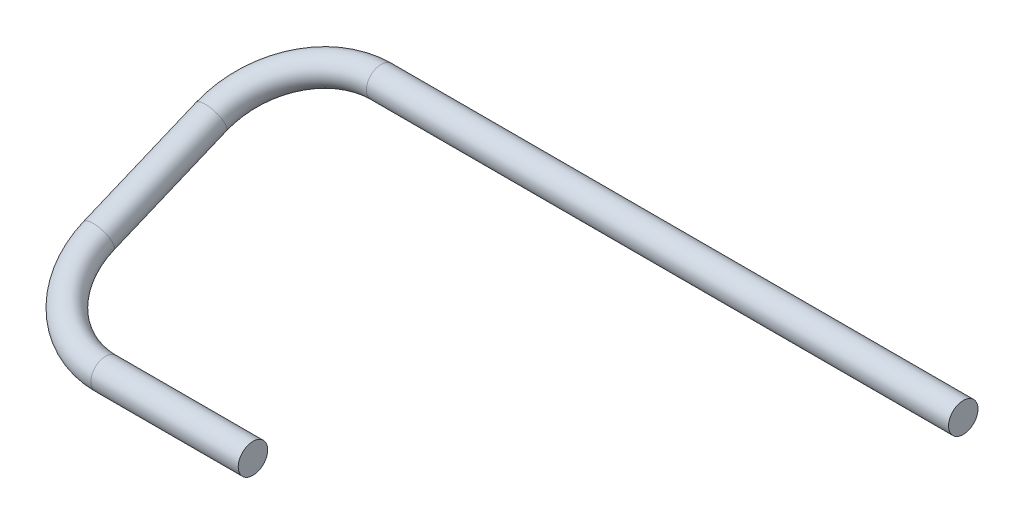
ISO-10303-21;
HEADER;
FILE_DESCRIPTION(('STEP AP214'),'2;1');
FILE_NAME('part.step','',(''),(''),'','','');
FILE_SCHEMA(('AUTOMOTIVE_DESIGN { 1 0 10303 214 1 1 1 1 }'));
ENDSEC;
DATA;
#1=APPLICATION_CONTEXT('core data for automotive mechanical design processes');
#2=APPLICATION_PROTOCOL_DEFINITION('international standard','automotive_design',2000,#1);
#3=PRODUCT_CONTEXT('',#1,'mechanical');
#4=PRODUCT('Part','Part','',(#3));
#5=PRODUCT_RELATED_PRODUCT_CATEGORY('part','',(#4));
#6=PRODUCT_DEFINITION_FORMATION('','',#4);
#7=PRODUCT_DEFINITION_CONTEXT('part definition',#1,'design');
#8=PRODUCT_DEFINITION('design','',#6,#7);
#9=PRODUCT_DEFINITION_SHAPE('','',#8);
#10=(LENGTH_UNIT() NAMED_UNIT(*) SI_UNIT(.MILLI.,.METRE.));
#11=(NAMED_UNIT(*) PLANE_ANGLE_UNIT() SI_UNIT($,.RADIAN.));
#12=(NAMED_UNIT(*) SI_UNIT($,.STERADIAN.) SOLID_ANGLE_UNIT());
#13=UNCERTAINTY_MEASURE_WITH_UNIT(LENGTH_MEASURE(1.E-05),#10,'distance_accuracy_value','');
#14=(GEOMETRIC_REPRESENTATION_CONTEXT(3) GLOBAL_UNCERTAINTY_ASSIGNED_CONTEXT((#13)) GLOBAL_UNIT_ASSIGNED_CONTEXT((#10,
#11,#12)) REPRESENTATION_CONTEXT('',''));
#15=CARTESIAN_POINT('',(0.,0.,0.));
#16=DIRECTION('',(0.,0.,1.));
#17=DIRECTION('',(1.,0.,0.));
#18=AXIS2_PLACEMENT_3D('',#15,#16,#17);
#19=CARTESIAN_POINT('',(-483.910454363053,1674.495,-105.298595711031));
#20=DIRECTION('',(-1.,0.,0.));
#21=DIRECTION('',(0.,0.,1.));
#22=AXIS2_PLACEMENT_3D('',#19,#20,#21);
#23=PLANE('',#22);
#24=CARTESIAN_POINT('',(-483.910454363053,1674.495,-105.298595711031));
#25=DIRECTION('',(-1.,0.,0.));
#26=DIRECTION('',(0.,0.,1.));
#27=AXIS2_PLACEMENT_3D('',#24,#25,#26);
#28=CIRCLE('',#27,6.34999999999999);
#29=CARTESIAN_POINT('',(-483.910454363053,1674.495,-98.9485957110313));
#30=VERTEX_POINT('',#29);
#31=EDGE_CURVE('E74',#30,#30,#28,.T.);
#32=ORIENTED_EDGE('',*,*,#31,.F.);
#33=EDGE_LOOP('',(#32));
#34=FACE_BOUND('',#33,.T.);
#35=ADVANCED_FACE('F52',(#34),#23,.F.);
#36=CARTESIAN_POINT('',(-296.632700307733,1724.025,-224.028000000002));
#37=DIRECTION('',(1.,0.,0.));
#38=DIRECTION('',(0.,0.710659292836595,-0.703536331332641));
#39=AXIS2_PLACEMENT_3D('',#36,#37,#38);
#40=PLANE('',#39);
#41=CARTESIAN_POINT('',(-296.632700307733,1724.025,-224.028000000002));
#42=DIRECTION('',(1.,0.,0.));
#43=DIRECTION('',(0.,0.710659292836595,-0.703536331332641));
#44=AXIS2_PLACEMENT_3D('',#41,#42,#43);
#45=CIRCLE('',#44,6.34999999999999);
#46=CARTESIAN_POINT('',(-296.632700307733,1728.53768650951,-228.495455703964));
#47=VERTEX_POINT('',#46);
#48=EDGE_CURVE('E13',#47,#47,#45,.T.);
#49=ORIENTED_EDGE('',*,*,#48,.T.);
#50=EDGE_LOOP('',(#49));
#51=FACE_BOUND('',#50,.T.);
#52=ADVANCED_FACE('F81',(#51),#40,.T.);
#53=CARTESIAN_POINT('',(-483.910454363053,1674.495,-105.298595711031));
#54=DIRECTION('',(-1.,0.,0.));
#55=DIRECTION('',(0.,0.,1.));
#56=AXIS2_PLACEMENT_3D('',#53,#54,#55);
#57=CYLINDRICAL_SURFACE('',#56,6.34999999999999);
#58=CARTESIAN_POINT('',(-547.410454363053,1674.495,-105.298595711031));
#59=DIRECTION('',(-1.,0.,0.));
#60=DIRECTION('',(0.,0.,1.));
#61=AXIS2_PLACEMENT_3D('',#58,#59,#60);
#62=CIRCLE('',#61,6.34999999999999);
#63=CARTESIAN_POINT('',(-547.410454363053,1672.05019363958,-99.438098986343));
#64=VERTEX_POINT('',#63);
#65=EDGE_CURVE('E71',#64,#64,#62,.T.);
#66=ORIENTED_EDGE('',*,*,#65,.F.);
#67=EDGE_LOOP('',(#66));
#68=FACE_BOUND('',#67,.T.);
#69=ORIENTED_EDGE('',*,*,#31,.T.);
#70=EDGE_LOOP('',(#69));
#71=FACE_BOUND('',#70,.T.);
#72=ADVANCED_FACE('F78',(#68,#71),#57,.T.);
#73=CARTESIAN_POINT('',(-547.410454363053,1689.16383816248,-140.46157605916));
#74=DIRECTION('',(0.,-0.922912870029626,-0.385008875655717));
#75=DIRECTION('',(0.,0.385008875655717,-0.922912870029626));
#76=AXIS2_PLACEMENT_3D('',#73,#74,#75);
#77=TOROIDAL_SURFACE('',#76,38.1000000000003,6.34999999999999);
#78=CARTESIAN_POINT('',(-585.510454363053,1689.16383816248,-140.46157605916));
#79=DIRECTION('',(0.,0.385008875655717,-0.922912870029626));
#80=DIRECTION('',(-0.922912870029626,0.355329646418297,0.148231834333679));
#81=AXIS2_PLACEMENT_3D('',#78,#79,#80);
#82=CIRCLE('',#81,6.34999999999999);
#83=CARTESIAN_POINT('',(-591.860454363053,1689.16383816248,-140.46157605916));
#84=VERTEX_POINT('',#83);
#85=EDGE_CURVE('E66',#84,#84,#82,.T.);
#86=CARTESIAN_POINT('',(-547.410454363053,1689.16383816248,-140.46157605916));
#87=DIRECTION('',(0.,-0.922912870029626,-0.385008875655717));
#88=DIRECTION('',(0.,0.385008875655717,-0.922912870029626));
#89=AXIS2_PLACEMENT_3D('',#86,#87,#88);
#90=CIRCLE('',#89,44.4500000000003);
#91=EDGE_CURVE('',#64,#84,#90,.T.);
#92=ORIENTED_EDGE('',*,*,#65,.T.);
#93=ORIENTED_EDGE('',*,*,#85,.F.);
#94=ORIENTED_EDGE('',*,*,#91,.T.);
#95=ORIENTED_EDGE('',*,*,#91,.F.);
#96=EDGE_LOOP('',(#92,#94,#93,#95));
#97=FACE_BOUND('',#96,.T.);
#98=ADVANCED_FACE('F99',(#97),#77,.T.);
#99=CARTESIAN_POINT('',(-585.510454363053,1689.16383816248,-140.46157605916));
#100=DIRECTION('',(0.,0.385008875655717,-0.922912870029625));
#101=DIRECTION('',(0.,0.922912870029625,0.385008875655717));
#102=AXIS2_PLACEMENT_3D('',#99,#100,#101);
#103=CYLINDRICAL_SURFACE('',#102,6.34999999999999);
#104=CARTESIAN_POINT('',(-585.510454363053,1709.35616183752,-188.865019651873));
#105=DIRECTION('',(0.,0.385008875655717,-0.922912870029626));
#106=DIRECTION('',(-0.922912870029626,0.355329646418297,0.14823183433368));
#107=AXIS2_PLACEMENT_3D('',#104,#105,#106);
#108=CIRCLE('',#107,6.34999999999999);
#109=CARTESIAN_POINT('',(-591.860454363053,1709.35616183752,-188.865019651873));
#110=VERTEX_POINT('',#109);
#111=EDGE_CURVE('E62',#110,#110,#108,.T.);
#112=ORIENTED_EDGE('',*,*,#111,.F.);
#113=EDGE_LOOP('',(#112));
#114=FACE_BOUND('',#113,.T.);
#115=ORIENTED_EDGE('',*,*,#85,.T.);
#116=EDGE_LOOP('',(#115));
#117=FACE_BOUND('',#116,.T.);
#118=ADVANCED_FACE('F93',(#114,#117),#103,.T.);
#119=CARTESIAN_POINT('',(-547.410454363053,1709.35616183752,-188.865019651873));
#120=DIRECTION('',(0.,-0.922912870029625,-0.385008875655718));
#121=DIRECTION('',(0.,0.385008875655718,-0.922912870029625));
#122=AXIS2_PLACEMENT_3D('',#119,#120,#121);
#123=TOROIDAL_SURFACE('',#122,38.1,6.34999999999999);
#124=CARTESIAN_POINT('',(-547.410454363053,1724.025,-224.028000000002));
#125=DIRECTION('',(1.,0.,0.));
#126=DIRECTION('',(0.,0.710659292836595,-0.703536331332641));
#127=AXIS2_PLACEMENT_3D('',#124,#125,#126);
#128=CIRCLE('',#127,6.34999999999999);
#129=CARTESIAN_POINT('',(-547.410454363053,1726.46980636041,-229.88849672469));
#130=VERTEX_POINT('',#129);
#131=EDGE_CURVE('E58',#130,#130,#128,.T.);
#132=CARTESIAN_POINT('',(-547.410454363053,1709.35616183752,-188.865019651873));
#133=DIRECTION('',(0.,-0.922912870029625,-0.385008875655718));
#134=DIRECTION('',(0.,0.385008875655718,-0.922912870029625));
#135=AXIS2_PLACEMENT_3D('',#132,#133,#134);
#136=CIRCLE('',#135,44.45);
#137=EDGE_CURVE('',#110,#130,#136,.T.);
#138=ORIENTED_EDGE('',*,*,#111,.T.);
#139=ORIENTED_EDGE('',*,*,#131,.F.);
#140=ORIENTED_EDGE('',*,*,#137,.T.);
#141=ORIENTED_EDGE('',*,*,#137,.F.);
#142=EDGE_LOOP('',(#138,#140,#139,#141));
#143=FACE_BOUND('',#142,.T.);
#144=ADVANCED_FACE('F87',(#143),#123,.T.);
#145=CARTESIAN_POINT('',(-547.410454363053,1724.025,-224.028000000002));
#146=DIRECTION('',(1.,0.,0.));
#147=DIRECTION('',(0.,0.,-1.));
#148=AXIS2_PLACEMENT_3D('',#145,#146,#147);
#149=CYLINDRICAL_SURFACE('',#148,6.34999999999999);
#150=ORIENTED_EDGE('',*,*,#48,.F.);
#151=EDGE_LOOP('',(#150));
#152=FACE_BOUND('',#151,.T.);
#153=ORIENTED_EDGE('',*,*,#131,.T.);
#154=EDGE_LOOP('',(#153));
#155=FACE_BOUND('',#154,.T.);
#156=ADVANCED_FACE('F85',(#152,#155),#149,.T.);
#157=CLOSED_SHELL('',(#35,#52,#72,#98,#118,#144,#156));
#158=MANIFOLD_SOLID_BREP('B2',#157);
#159=ADVANCED_BREP_SHAPE_REPRESENTATION('',(#18,#158),#14);
#160=SHAPE_DEFINITION_REPRESENTATION(#9,#159);
ENDSEC;
END-ISO-10303-21;
